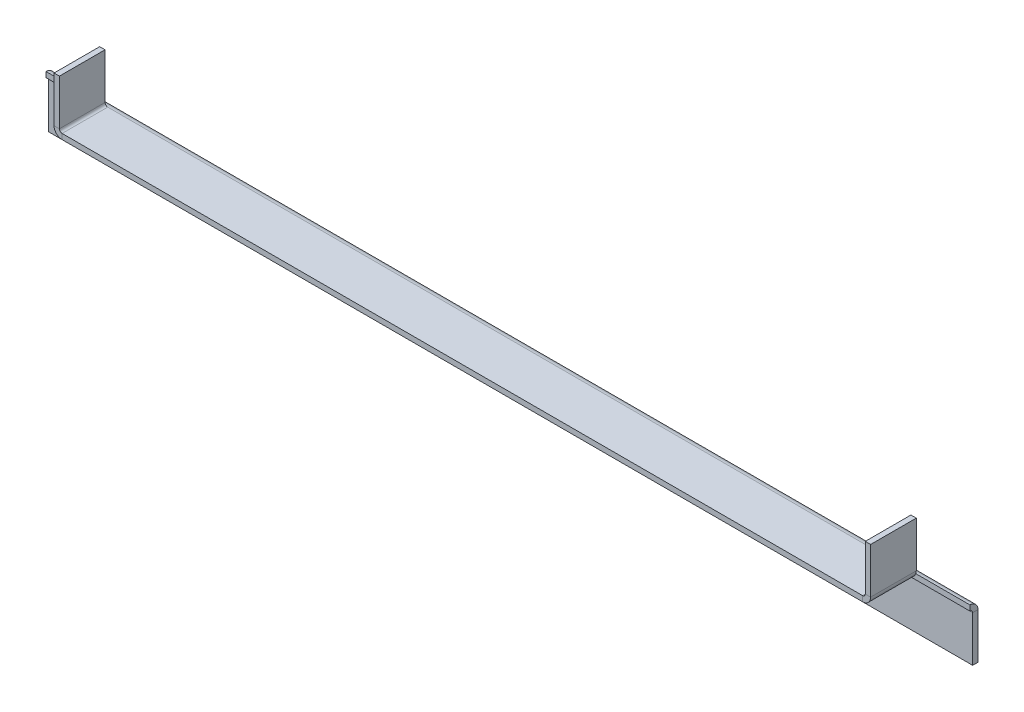
ISO-10303-21;
HEADER;
FILE_DESCRIPTION(('STEP AP214'),'2;1');
FILE_NAME('part.step','',(''),(''),'','','');
FILE_SCHEMA(('AUTOMOTIVE_DESIGN { 1 0 10303 214 1 1 1 1 }'));
ENDSEC;
DATA;
#1=APPLICATION_CONTEXT('core data for automotive mechanical design processes');
#2=APPLICATION_PROTOCOL_DEFINITION('international standard','automotive_design',2000,#1);
#3=PRODUCT_CONTEXT('',#1,'mechanical');
#4=PRODUCT('Part','Part','',(#3));
#5=PRODUCT_RELATED_PRODUCT_CATEGORY('part','',(#4));
#6=PRODUCT_DEFINITION_FORMATION('','',#4);
#7=PRODUCT_DEFINITION_CONTEXT('part definition',#1,'design');
#8=PRODUCT_DEFINITION('design','',#6,#7);
#9=PRODUCT_DEFINITION_SHAPE('','',#8);
#10=(LENGTH_UNIT() NAMED_UNIT(*) SI_UNIT(.MILLI.,.METRE.));
#11=(NAMED_UNIT(*) PLANE_ANGLE_UNIT() SI_UNIT($,.RADIAN.));
#12=(NAMED_UNIT(*) SI_UNIT($,.STERADIAN.) SOLID_ANGLE_UNIT());
#13=UNCERTAINTY_MEASURE_WITH_UNIT(LENGTH_MEASURE(1.E-05),#10,'distance_accuracy_value','');
#14=(GEOMETRIC_REPRESENTATION_CONTEXT(3) GLOBAL_UNCERTAINTY_ASSIGNED_CONTEXT((#13)) GLOBAL_UNIT_ASSIGNED_CONTEXT((#10,
#11,#12)) REPRESENTATION_CONTEXT('',''));
#15=CARTESIAN_POINT('',(0.,0.,0.));
#16=DIRECTION('',(0.,0.,1.));
#17=DIRECTION('',(1.,0.,0.));
#18=AXIS2_PLACEMENT_3D('',#15,#16,#17);
#19=CARTESIAN_POINT('',(344.2,20.,0.999999999999992));
#20=DIRECTION('',(0.,0.,1.));
#21=DIRECTION('',(0.,-1.,0.));
#22=AXIS2_PLACEMENT_3D('',#19,#20,#21);
#23=PLANE('',#22);
#24=DIRECTION('',(-1.,0.,0.));
#25=VECTOR('',#24,1.);
#26=CARTESIAN_POINT('',(344.2,20.,0.999999999999992));
#27=LINE('',#26,#25);
#28=CARTESIAN_POINT('',(344.2,20.,0.999999999999992));
#29=VERTEX_POINT('',#28);
#30=CARTESIAN_POINT('',(324.028427124746,20.,0.999999999999993));
#31=VERTEX_POINT('',#30);
#32=EDGE_CURVE('E290',#29,#31,#27,.T.);
#33=ORIENTED_EDGE('',*,*,#32,.T.);
#34=CARTESIAN_POINT('',(321.2,21.,0.99999999999999));
#35=DIRECTION('',(0.,0.,-1.));
#36=DIRECTION('',(0.,1.,0.));
#37=AXIS2_PLACEMENT_3D('',#34,#35,#36);
#38=CIRCLE('',#37,3.);
#39=CARTESIAN_POINT('',(321.2,18.,0.999999999999998));
#40=VERTEX_POINT('',#39);
#41=EDGE_CURVE('E13',#31,#40,#38,.T.);
#42=ORIENTED_EDGE('',*,*,#41,.T.);
#43=DIRECTION('',(-1.,0.,0.));
#44=VECTOR('',#43,1.);
#45=CARTESIAN_POINT('',(344.2,18.,0.999999999999997));
#46=LINE('',#45,#44);
#47=CARTESIAN_POINT('',(344.2,18.,0.999999999999999));
#48=VERTEX_POINT('',#47);
#49=EDGE_CURVE('E359',#48,#40,#46,.T.);
#50=ORIENTED_EDGE('',*,*,#49,.F.);
#51=DIRECTION('',(0.,-1.,0.));
#52=VECTOR('',#51,1.);
#53=CARTESIAN_POINT('',(344.2,20.,0.99999999999999));
#54=LINE('',#53,#52);
#55=EDGE_CURVE('E345',#48,#29,#54,.F.);
#56=ORIENTED_EDGE('',*,*,#55,.T.);
#57=EDGE_LOOP('',(#33,#42,#50,#56));
#58=FACE_BOUND('',#57,.T.);
#59=ADVANCED_FACE('F98',(#58),#23,.T.);
#60=CARTESIAN_POINT('',(0.,20.,0.));
#61=DIRECTION('',(0.,-1.,0.));
#62=DIRECTION('',(0.,0.,-1.));
#63=AXIS2_PLACEMENT_3D('',#60,#61,#62);
#64=PLANE('',#63);
#65=DIRECTION('',(0.,0.,-1.));
#66=VECTOR('',#65,1.);
#67=CARTESIAN_POINT('',(321.2,20.,0.999999999999994));
#68=LINE('',#67,#66);
#69=CARTESIAN_POINT('',(321.2,20.,0.999999999999994));
#70=VERTEX_POINT('',#69);
#71=CARTESIAN_POINT('',(321.2,20.0000000000001,18.));
#72=VERTEX_POINT('',#71);
#73=EDGE_CURVE('E283',#70,#72,#68,.F.);
#74=ORIENTED_EDGE('',*,*,#73,.F.);
#75=DIRECTION('',(-1.,0.,0.));
#76=VECTOR('',#75,1.);
#77=CARTESIAN_POINT('',(344.2,20.,0.99999999999999));
#78=LINE('',#77,#76);
#79=CARTESIAN_POINT('',(23.,20.,0.999999999999994));
#80=VERTEX_POINT('',#79);
#81=EDGE_CURVE('E355',#80,#70,#78,.F.);
#82=ORIENTED_EDGE('',*,*,#81,.F.);
#83=DIRECTION('',(0.,0.,1.));
#84=VECTOR('',#83,1.);
#85=CARTESIAN_POINT('',(23.,20.0000000000001,18.));
#86=LINE('',#85,#84);
#87=CARTESIAN_POINT('',(23.,20.0000000000001,18.));
#88=VERTEX_POINT('',#87);
#89=EDGE_CURVE('E338',#88,#80,#86,.F.);
#90=ORIENTED_EDGE('',*,*,#89,.F.);
#91=DIRECTION('',(1.,0.,0.));
#92=VECTOR('',#91,1.);
#93=CARTESIAN_POINT('',(0.,20.0000000000001,18.));
#94=LINE('',#93,#92);
#95=EDGE_CURVE('E346',#88,#72,#94,.T.);
#96=ORIENTED_EDGE('',*,*,#95,.T.);
#97=EDGE_LOOP('',(#74,#82,#90,#96));
#98=FACE_BOUND('',#97,.T.);
#99=ADVANCED_FACE('F427',(#98),#64,.F.);
#100=CARTESIAN_POINT('',(0.,18.,0.));
#101=DIRECTION('',(0.,-1.,0.));
#102=DIRECTION('',(0.,0.,-1.));
#103=AXIS2_PLACEMENT_3D('',#100,#101,#102);
#104=PLANE('',#103);
#105=CARTESIAN_POINT('',(23.,18.,1.));
#106=VERTEX_POINT('',#105);
#107=EDGE_CURVE('E362',#40,#106,#46,.T.);
#108=ORIENTED_EDGE('',*,*,#107,.F.);
#109=DIRECTION('',(0.,0.,-1.));
#110=VECTOR('',#109,1.);
#111=CARTESIAN_POINT('',(321.2,18.,1.));
#112=LINE('',#111,#110);
#113=CARTESIAN_POINT('',(321.2,18.0000000000001,18.));
#114=VERTEX_POINT('',#113);
#115=EDGE_CURVE('E274',#40,#114,#112,.F.);
#116=ORIENTED_EDGE('',*,*,#115,.T.);
#117=DIRECTION('',(-1.,0.,0.));
#118=VECTOR('',#117,1.);
#119=CARTESIAN_POINT('',(344.2,18.0000000000001,18.));
#120=LINE('',#119,#118);
#121=CARTESIAN_POINT('',(23.,18.0000000000001,18.));
#122=VERTEX_POINT('',#121);
#123=EDGE_CURVE('E349',#122,#114,#120,.F.);
#124=ORIENTED_EDGE('',*,*,#123,.F.);
#125=DIRECTION('',(0.,0.,1.));
#126=VECTOR('',#125,1.);
#127=CARTESIAN_POINT('',(23.,18.0000000000001,18.));
#128=LINE('',#127,#126);
#129=EDGE_CURVE('E324',#122,#106,#128,.F.);
#130=ORIENTED_EDGE('',*,*,#129,.T.);
#131=EDGE_LOOP('',(#108,#116,#124,#130));
#132=FACE_BOUND('',#131,.T.);
#133=ADVANCED_FACE('F433',(#132),#104,.T.);
#134=CARTESIAN_POINT('',(344.2,20.0000000000001,18.));
#135=DIRECTION('',(0.,0.,-1.));
#136=DIRECTION('',(0.,1.,0.));
#137=AXIS2_PLACEMENT_3D('',#134,#135,#136);
#138=PLANE('',#137);
#139=DIRECTION('',(0.,-1.,0.));
#140=VECTOR('',#139,1.);
#141=CARTESIAN_POINT('',(321.2,20.0000000000001,18.));
#142=LINE('',#141,#140);
#143=EDGE_CURVE('E123',#72,#114,#142,.T.);
#144=ORIENTED_EDGE('',*,*,#143,.F.);
#145=ORIENTED_EDGE('',*,*,#95,.F.);
#146=DIRECTION('',(0.,-1.,0.));
#147=VECTOR('',#146,1.);
#148=CARTESIAN_POINT('',(23.,20.0000000000001,18.));
#149=LINE('',#148,#147);
#150=EDGE_CURVE('E332',#88,#122,#149,.T.);
#151=ORIENTED_EDGE('',*,*,#150,.T.);
#152=ORIENTED_EDGE('',*,*,#123,.T.);
#153=EDGE_LOOP('',(#144,#145,#151,#152));
#154=FACE_BOUND('',#153,.T.);
#155=ADVANCED_FACE('F481',(#154),#138,.F.);
#156=CARTESIAN_POINT('',(23.,20.,0.999999999999994));
#157=DIRECTION('',(0.,0.,1.));
#158=DIRECTION('',(0.,-1.,0.));
#159=AXIS2_PLACEMENT_3D('',#156,#157,#158);
#160=PLANE('',#159);
#161=CARTESIAN_POINT('',(0.,18.,0.999999999999999));
#162=VERTEX_POINT('',#161);
#163=EDGE_CURVE('E363',#106,#162,#46,.T.);
#164=ORIENTED_EDGE('',*,*,#163,.F.);
#165=CARTESIAN_POINT('',(23.,21.,0.99999999999999));
#166=DIRECTION('',(0.,0.,1.));
#167=DIRECTION('',(0.,-1.,0.));
#168=AXIS2_PLACEMENT_3D('',#165,#166,#167);
#169=CIRCLE('',#168,3.);
#170=CARTESIAN_POINT('',(20.1715728752538,20.,0.999999999999994));
#171=VERTEX_POINT('',#170);
#172=EDGE_CURVE('E329',#106,#171,#169,.F.);
#173=ORIENTED_EDGE('',*,*,#172,.T.);
#174=CARTESIAN_POINT('',(0.,20.,0.999999999999994));
#175=VERTEX_POINT('',#174);
#176=EDGE_CURVE('E351',#175,#171,#78,.F.);
#177=ORIENTED_EDGE('',*,*,#176,.F.);
#178=DIRECTION('',(0.,-1.,0.));
#179=VECTOR('',#178,1.);
#180=CARTESIAN_POINT('',(0.,18.,1.));
#181=LINE('',#180,#179);
#182=EDGE_CURVE('E356',#162,#175,#181,.F.);
#183=ORIENTED_EDGE('',*,*,#182,.F.);
#184=EDGE_LOOP('',(#164,#173,#177,#183));
#185=FACE_BOUND('',#184,.T.);
#186=ADVANCED_FACE('F478',(#185),#160,.T.);
#187=CARTESIAN_POINT('',(0.,0.,-2.));
#188=DIRECTION('',(1.,0.,0.));
#189=DIRECTION('',(0.,1.,0.));
#190=AXIS2_PLACEMENT_3D('',#187,#188,#189);
#191=PLANE('',#190);
#192=DIRECTION('',(0.,1.,0.));
#193=VECTOR('',#192,1.);
#194=CARTESIAN_POINT('',(0.,0.,0.));
#195=LINE('',#194,#193);
#196=CARTESIAN_POINT('',(0.,0.,0.));
#197=VERTEX_POINT('',#196);
#198=CARTESIAN_POINT('',(0.,17.,0.));
#199=VERTEX_POINT('',#198);
#200=EDGE_CURVE('E385',#197,#199,#195,.T.);
#201=ORIENTED_EDGE('',*,*,#200,.T.);
#202=DIRECTION('',(0.,0.,-1.));
#203=VECTOR('',#202,1.);
#204=CARTESIAN_POINT('',(0.,17.,0.));
#205=LINE('',#204,#203);
#206=CARTESIAN_POINT('',(0.,17.,-2.));
#207=VERTEX_POINT('',#206);
#208=EDGE_CURVE('E371',#199,#207,#205,.T.);
#209=ORIENTED_EDGE('',*,*,#208,.T.);
#210=DIRECTION('',(0.,1.,0.));
#211=VECTOR('',#210,1.);
#212=CARTESIAN_POINT('',(0.,0.,-2.));
#213=LINE('',#212,#211);
#214=CARTESIAN_POINT('',(0.,0.,-2.));
#215=VERTEX_POINT('',#214);
#216=EDGE_CURVE('E388',#215,#207,#213,.T.);
#217=ORIENTED_EDGE('',*,*,#216,.F.);
#218=DIRECTION('',(0.,0.,-1.));
#219=VECTOR('',#218,1.);
#220=CARTESIAN_POINT('',(0.,0.,-2.));
#221=LINE('',#220,#219);
#222=EDGE_CURVE('E397',#197,#215,#221,.T.);
#223=ORIENTED_EDGE('',*,*,#222,.F.);
#224=EDGE_LOOP('',(#201,#209,#217,#223));
#225=FACE_BOUND('',#224,.T.);
#226=ADVANCED_FACE('F480',(#225),#191,.F.);
#227=CARTESIAN_POINT('',(344.2,0.,-2.));
#228=DIRECTION('',(0.,0.,1.));
#229=DIRECTION('',(1.,0.,0.));
#230=AXIS2_PLACEMENT_3D('',#227,#228,#229);
#231=PLANE('',#230);
#232=DIRECTION('',(-1.,0.,0.));
#233=VECTOR('',#232,1.);
#234=CARTESIAN_POINT('',(0.,17.,-2.));
#235=LINE('',#234,#233);
#236=CARTESIAN_POINT('',(344.2,17.,-2.));
#237=VERTEX_POINT('',#236);
#238=EDGE_CURVE('E366',#207,#237,#235,.F.);
#239=ORIENTED_EDGE('',*,*,#238,.T.);
#240=DIRECTION('',(0.,1.,0.));
#241=VECTOR('',#240,1.);
#242=CARTESIAN_POINT('',(344.2,0.,-2.));
#243=LINE('',#242,#241);
#244=CARTESIAN_POINT('',(344.2,0.,-2.));
#245=VERTEX_POINT('',#244);
#246=EDGE_CURVE('E390',#245,#237,#243,.T.);
#247=ORIENTED_EDGE('',*,*,#246,.F.);
#248=DIRECTION('',(-1.,0.,0.));
#249=VECTOR('',#248,1.);
#250=CARTESIAN_POINT('',(344.2,0.,-2.));
#251=LINE('',#250,#249);
#252=EDGE_CURVE('E394',#245,#215,#251,.T.);
#253=ORIENTED_EDGE('',*,*,#252,.T.);
#254=ORIENTED_EDGE('',*,*,#216,.T.);
#255=EDGE_LOOP('',(#239,#247,#253,#254));
#256=FACE_BOUND('',#255,.T.);
#257=ADVANCED_FACE('F412',(#256),#231,.F.);
#258=CARTESIAN_POINT('',(344.2,0.,0.));
#259=DIRECTION('',(0.,0.,1.));
#260=DIRECTION('',(1.,0.,0.));
#261=AXIS2_PLACEMENT_3D('',#258,#259,#260);
#262=PLANE('',#261);
#263=DIRECTION('',(0.,1.,0.));
#264=VECTOR('',#263,1.);
#265=CARTESIAN_POINT('',(344.2,0.,0.));
#266=LINE('',#265,#264);
#267=CARTESIAN_POINT('',(344.2,0.,0.));
#268=VERTEX_POINT('',#267);
#269=CARTESIAN_POINT('',(344.2,17.,0.));
#270=VERTEX_POINT('',#269);
#271=EDGE_CURVE('E400',#268,#270,#266,.T.);
#272=ORIENTED_EDGE('',*,*,#271,.T.);
#273=DIRECTION('',(-1.,0.,0.));
#274=VECTOR('',#273,1.);
#275=CARTESIAN_POINT('',(0.,17.,0.));
#276=LINE('',#275,#274);
#277=EDGE_CURVE('E377',#199,#270,#276,.F.);
#278=ORIENTED_EDGE('',*,*,#277,.F.);
#279=ORIENTED_EDGE('',*,*,#200,.F.);
#280=DIRECTION('',(1.,0.,0.));
#281=VECTOR('',#280,1.);
#282=CARTESIAN_POINT('',(344.2,0.,0.));
#283=LINE('',#282,#281);
#284=EDGE_CURVE('E391',#268,#197,#283,.F.);
#285=ORIENTED_EDGE('',*,*,#284,.F.);
#286=EDGE_LOOP('',(#272,#278,#279,#285));
#287=FACE_BOUND('',#286,.T.);
#288=ADVANCED_FACE('F424',(#287),#262,.T.);
#289=CARTESIAN_POINT('',(344.2,0.,-2.));
#290=DIRECTION('',(1.,0.,0.));
#291=DIRECTION('',(0.,1.,0.));
#292=AXIS2_PLACEMENT_3D('',#289,#290,#291);
#293=PLANE('',#292);
#294=DIRECTION('',(0.,0.,-1.));
#295=VECTOR('',#294,1.);
#296=CARTESIAN_POINT('',(344.2,17.,0.));
#297=LINE('',#296,#295);
#298=EDGE_CURVE('E382',#270,#237,#297,.T.);
#299=ORIENTED_EDGE('',*,*,#298,.F.);
#300=ORIENTED_EDGE('',*,*,#271,.F.);
#301=DIRECTION('',(0.,0.,-1.));
#302=VECTOR('',#301,1.);
#303=CARTESIAN_POINT('',(344.2,0.,-2.));
#304=LINE('',#303,#302);
#305=EDGE_CURVE('E102',#268,#245,#304,.T.);
#306=ORIENTED_EDGE('',*,*,#305,.T.);
#307=ORIENTED_EDGE('',*,*,#246,.T.);
#308=EDGE_LOOP('',(#299,#300,#306,#307));
#309=FACE_BOUND('',#308,.T.);
#310=ADVANCED_FACE('F100',(#309),#293,.T.);
#311=CARTESIAN_POINT('',(344.2,0.,-2.));
#312=DIRECTION('',(0.,1.,0.));
#313=DIRECTION('',(-1.,0.,0.));
#314=AXIS2_PLACEMENT_3D('',#311,#312,#313);
#315=PLANE('',#314);
#316=ORIENTED_EDGE('',*,*,#305,.F.);
#317=ORIENTED_EDGE('',*,*,#284,.T.);
#318=ORIENTED_EDGE('',*,*,#222,.T.);
#319=ORIENTED_EDGE('',*,*,#252,.F.);
#320=EDGE_LOOP('',(#316,#317,#318,#319));
#321=FACE_BOUND('',#320,.T.);
#322=ADVANCED_FACE('F414',(#321),#315,.F.);
#323=CARTESIAN_POINT('',(344.2,17.,1.));
#324=DIRECTION('',(1.,0.,0.));
#325=DIRECTION('',(0.,0.,-1.));
#326=AXIS2_PLACEMENT_3D('',#323,#324,#325);
#327=PLANE('',#326);
#328=ORIENTED_EDGE('',*,*,#55,.F.);
#329=CARTESIAN_POINT('',(344.2,17.,1.));
#330=DIRECTION('',(-1.,0.,0.));
#331=DIRECTION('',(0.,0.,1.));
#332=AXIS2_PLACEMENT_3D('',#329,#330,#331);
#333=CIRCLE('',#332,1.);
#334=EDGE_CURVE('E374',#270,#48,#333,.F.);
#335=ORIENTED_EDGE('',*,*,#334,.F.);
#336=ORIENTED_EDGE('',*,*,#298,.T.);
#337=CARTESIAN_POINT('',(344.2,17.,1.));
#338=DIRECTION('',(-1.,0.,0.));
#339=DIRECTION('',(0.,0.,1.));
#340=AXIS2_PLACEMENT_3D('',#337,#338,#339);
#341=CIRCLE('',#340,3.);
#342=EDGE_CURVE('E368',#237,#29,#341,.F.);
#343=ORIENTED_EDGE('',*,*,#342,.T.);
#344=EDGE_LOOP('',(#328,#335,#336,#343));
#345=FACE_BOUND('',#344,.T.);
#346=ADVANCED_FACE('F416',(#345),#327,.T.);
#347=CARTESIAN_POINT('',(0.,17.,1.));
#348=DIRECTION('',(1.,0.,0.));
#349=DIRECTION('',(0.,0.,-1.));
#350=AXIS2_PLACEMENT_3D('',#347,#348,#349);
#351=PLANE('',#350);
#352=CARTESIAN_POINT('',(0.,17.,1.));
#353=DIRECTION('',(-1.,0.,0.));
#354=DIRECTION('',(0.,0.,1.));
#355=AXIS2_PLACEMENT_3D('',#352,#353,#354);
#356=CIRCLE('',#355,1.);
#357=EDGE_CURVE('E348',#162,#199,#356,.T.);
#358=ORIENTED_EDGE('',*,*,#357,.F.);
#359=ORIENTED_EDGE('',*,*,#182,.T.);
#360=CARTESIAN_POINT('',(0.,17.,1.));
#361=DIRECTION('',(-1.,0.,0.));
#362=DIRECTION('',(0.,0.,1.));
#363=AXIS2_PLACEMENT_3D('',#360,#361,#362);
#364=CIRCLE('',#363,3.);
#365=EDGE_CURVE('E369',#175,#207,#364,.T.);
#366=ORIENTED_EDGE('',*,*,#365,.T.);
#367=ORIENTED_EDGE('',*,*,#208,.F.);
#368=EDGE_LOOP('',(#358,#359,#366,#367));
#369=FACE_BOUND('',#368,.T.);
#370=ADVANCED_FACE('F421',(#369),#351,.F.);
#371=CARTESIAN_POINT('',(0.,17.,1.));
#372=DIRECTION('',(-1.,0.,0.));
#373=DIRECTION('',(0.,1.,0.));
#374=AXIS2_PLACEMENT_3D('',#371,#372,#373);
#375=CYLINDRICAL_SURFACE('',#374,3.);
#376=ORIENTED_EDGE('',*,*,#238,.F.);
#377=ORIENTED_EDGE('',*,*,#365,.F.);
#378=ORIENTED_EDGE('',*,*,#176,.T.);
#379=EDGE_CURVE('E354',#171,#80,#78,.F.);
#380=ORIENTED_EDGE('',*,*,#379,.T.);
#381=ORIENTED_EDGE('',*,*,#81,.T.);
#382=EDGE_CURVE('E115',#31,#70,#27,.T.);
#383=ORIENTED_EDGE('',*,*,#382,.F.);
#384=ORIENTED_EDGE('',*,*,#32,.F.);
#385=ORIENTED_EDGE('',*,*,#342,.F.);
#386=EDGE_LOOP('',(#376,#377,#378,#380,#381,#383,#384,#385));
#387=FACE_BOUND('',#386,.T.);
#388=ADVANCED_FACE('F489',(#387),#375,.T.);
#389=CARTESIAN_POINT('',(0.,17.,1.));
#390=DIRECTION('',(-1.,0.,0.));
#391=DIRECTION('',(0.,1.,0.));
#392=AXIS2_PLACEMENT_3D('',#389,#390,#391);
#393=CYLINDRICAL_SURFACE('',#392,1.);
#394=ORIENTED_EDGE('',*,*,#277,.T.);
#395=ORIENTED_EDGE('',*,*,#334,.T.);
#396=ORIENTED_EDGE('',*,*,#49,.T.);
#397=ORIENTED_EDGE('',*,*,#107,.T.);
#398=ORIENTED_EDGE('',*,*,#163,.T.);
#399=ORIENTED_EDGE('',*,*,#357,.T.);
#400=EDGE_LOOP('',(#394,#395,#396,#397,#398,#399));
#401=FACE_BOUND('',#400,.T.);
#402=ADVANCED_FACE('F473',(#401),#393,.F.);
#403=CARTESIAN_POINT('',(23.,21.,0.99999999999999));
#404=DIRECTION('',(0.,0.,-1.));
#405=DIRECTION('',(0.,1.,0.));
#406=AXIS2_PLACEMENT_3D('',#403,#404,#405);
#407=PLANE('',#406);
#408=ORIENTED_EDGE('',*,*,#379,.F.);
#409=CARTESIAN_POINT('',(20.,21.,0.99999999999999));
#410=VERTEX_POINT('',#409);
#411=EDGE_CURVE('E327',#171,#410,#169,.F.);
#412=ORIENTED_EDGE('',*,*,#411,.T.);
#413=DIRECTION('',(1.,0.,0.));
#414=VECTOR('',#413,1.);
#415=CARTESIAN_POINT('',(20.,21.,0.999999999999991));
#416=LINE('',#415,#414);
#417=CARTESIAN_POINT('',(22.,21.,0.99999999999999));
#418=VERTEX_POINT('',#417);
#419=EDGE_CURVE('E292',#418,#410,#416,.F.);
#420=ORIENTED_EDGE('',*,*,#419,.F.);
#421=CARTESIAN_POINT('',(23.,21.,0.99999999999999));
#422=DIRECTION('',(0.,0.,1.));
#423=DIRECTION('',(0.,-1.,0.));
#424=AXIS2_PLACEMENT_3D('',#421,#422,#423);
#425=CIRCLE('',#424,1.);
#426=EDGE_CURVE('E335',#80,#418,#425,.F.);
#427=ORIENTED_EDGE('',*,*,#426,.F.);
#428=EDGE_LOOP('',(#408,#412,#420,#427));
#429=FACE_BOUND('',#428,.T.);
#430=ADVANCED_FACE('F470',(#429),#407,.T.);
#431=CARTESIAN_POINT('',(23.,21.0000000000001,18.));
#432=DIRECTION('',(0.,0.,-1.));
#433=DIRECTION('',(0.,1.,0.));
#434=AXIS2_PLACEMENT_3D('',#431,#432,#433);
#435=PLANE('',#434);
#436=CARTESIAN_POINT('',(23.,21.0000000000001,18.));
#437=DIRECTION('',(0.,0.,1.));
#438=DIRECTION('',(0.,-1.,0.));
#439=AXIS2_PLACEMENT_3D('',#436,#437,#438);
#440=CIRCLE('',#439,1.);
#441=CARTESIAN_POINT('',(22.,21.0000000000001,18.));
#442=VERTEX_POINT('',#441);
#443=EDGE_CURVE('E296',#442,#88,#440,.T.);
#444=ORIENTED_EDGE('',*,*,#443,.F.);
#445=DIRECTION('',(1.,0.,0.));
#446=VECTOR('',#445,1.);
#447=CARTESIAN_POINT('',(22.,21.0000000000001,18.));
#448=LINE('',#447,#446);
#449=CARTESIAN_POINT('',(20.,21.,18.));
#450=VERTEX_POINT('',#449);
#451=EDGE_CURVE('E317',#442,#450,#448,.F.);
#452=ORIENTED_EDGE('',*,*,#451,.T.);
#453=CARTESIAN_POINT('',(23.,21.0000000000001,18.));
#454=DIRECTION('',(0.,0.,1.));
#455=DIRECTION('',(0.,-1.,0.));
#456=AXIS2_PLACEMENT_3D('',#453,#454,#455);
#457=CIRCLE('',#456,3.);
#458=EDGE_CURVE('E328',#450,#122,#457,.T.);
#459=ORIENTED_EDGE('',*,*,#458,.T.);
#460=ORIENTED_EDGE('',*,*,#150,.F.);
#461=EDGE_LOOP('',(#444,#452,#459,#460));
#462=FACE_BOUND('',#461,.T.);
#463=ADVANCED_FACE('F465',(#462),#435,.F.);
#464=CARTESIAN_POINT('',(23.,21.0000000000001,18.));
#465=DIRECTION('',(0.,0.,1.));
#466=DIRECTION('',(-1.,0.,0.));
#467=AXIS2_PLACEMENT_3D('',#464,#465,#466);
#468=CYLINDRICAL_SURFACE('',#467,3.);
#469=ORIENTED_EDGE('',*,*,#129,.F.);
#470=ORIENTED_EDGE('',*,*,#458,.F.);
#471=DIRECTION('',(0.,0.,1.));
#472=VECTOR('',#471,1.);
#473=CARTESIAN_POINT('',(20.,21.,0.999999999999965));
#474=LINE('',#473,#472);
#475=EDGE_CURVE('E314',#450,#410,#474,.F.);
#476=ORIENTED_EDGE('',*,*,#475,.T.);
#477=ORIENTED_EDGE('',*,*,#411,.F.);
#478=ORIENTED_EDGE('',*,*,#172,.F.);
#479=EDGE_LOOP('',(#469,#470,#476,#477,#478));
#480=FACE_BOUND('',#479,.T.);
#481=ADVANCED_FACE('F462',(#480),#468,.T.);
#482=CARTESIAN_POINT('',(23.,21.0000000000001,18.));
#483=DIRECTION('',(0.,0.,1.));
#484=DIRECTION('',(-1.,0.,0.));
#485=AXIS2_PLACEMENT_3D('',#482,#483,#484);
#486=CYLINDRICAL_SURFACE('',#485,1.);
#487=ORIENTED_EDGE('',*,*,#89,.T.);
#488=ORIENTED_EDGE('',*,*,#426,.T.);
#489=DIRECTION('',(0.,0.,1.));
#490=VECTOR('',#489,1.);
#491=CARTESIAN_POINT('',(22.,21.,0.999999999999965));
#492=LINE('',#491,#490);
#493=EDGE_CURVE('E320',#418,#442,#492,.T.);
#494=ORIENTED_EDGE('',*,*,#493,.T.);
#495=ORIENTED_EDGE('',*,*,#443,.T.);
#496=EDGE_LOOP('',(#487,#488,#494,#495));
#497=FACE_BOUND('',#496,.T.);
#498=ADVANCED_FACE('F460',(#497),#486,.F.);
#499=CARTESIAN_POINT('',(20.,20.,0.999999999999994));
#500=DIRECTION('',(0.,0.,1.));
#501=DIRECTION('',(0.,-1.,0.));
#502=AXIS2_PLACEMENT_3D('',#499,#500,#501);
#503=PLANE('',#502);
#504=ORIENTED_EDGE('',*,*,#419,.T.);
#505=DIRECTION('',(0.,-1.,0.));
#506=VECTOR('',#505,1.);
#507=CARTESIAN_POINT('',(20.0000000000001,0.,1.00000000000006));
#508=LINE('',#507,#506);
#509=CARTESIAN_POINT('',(19.9999999999999,38.,0.999999999999935));
#510=VERTEX_POINT('',#509);
#511=EDGE_CURVE('E304',#510,#410,#508,.T.);
#512=ORIENTED_EDGE('',*,*,#511,.F.);
#513=DIRECTION('',(1.,0.,0.));
#514=VECTOR('',#513,1.);
#515=CARTESIAN_POINT('',(19.9999999999999,38.,0.999999999999935));
#516=LINE('',#515,#514);
#517=CARTESIAN_POINT('',(21.9999999999999,38.,0.999999999999935));
#518=VERTEX_POINT('',#517);
#519=EDGE_CURVE('E297',#510,#518,#516,.T.);
#520=ORIENTED_EDGE('',*,*,#519,.T.);
#521=DIRECTION('',(0.,1.,0.));
#522=VECTOR('',#521,1.);
#523=CARTESIAN_POINT('',(22.,20.,0.999999999999994));
#524=LINE('',#523,#522);
#525=EDGE_CURVE('E311',#518,#418,#524,.F.);
#526=ORIENTED_EDGE('',*,*,#525,.T.);
#527=EDGE_LOOP('',(#504,#512,#520,#526));
#528=FACE_BOUND('',#527,.T.);
#529=ADVANCED_FACE('F456',(#528),#503,.F.);
#530=CARTESIAN_POINT('',(19.9999999999999,38.0000000000001,17.9999999999999));
#531=DIRECTION('',(0.,0.,-1.));
#532=DIRECTION('',(0.,1.,0.));
#533=AXIS2_PLACEMENT_3D('',#530,#531,#532);
#534=PLANE('',#533);
#535=ORIENTED_EDGE('',*,*,#451,.F.);
#536=DIRECTION('',(0.,-1.,0.));
#537=VECTOR('',#536,1.);
#538=CARTESIAN_POINT('',(21.9999999999999,38.0000000000001,17.9999999999999));
#539=LINE('',#538,#537);
#540=CARTESIAN_POINT('',(21.9999999999999,38.0000000000001,17.9999999999999));
#541=VERTEX_POINT('',#540);
#542=EDGE_CURVE('E309',#442,#541,#539,.F.);
#543=ORIENTED_EDGE('',*,*,#542,.T.);
#544=DIRECTION('',(1.,0.,0.));
#545=VECTOR('',#544,1.);
#546=CARTESIAN_POINT('',(19.9999999999999,38.0000000000001,17.9999999999999));
#547=LINE('',#546,#545);
#548=CARTESIAN_POINT('',(19.9999999999999,38.0000000000001,17.9999999999999));
#549=VERTEX_POINT('',#548);
#550=EDGE_CURVE('E293',#549,#541,#547,.T.);
#551=ORIENTED_EDGE('',*,*,#550,.F.);
#552=DIRECTION('',(0.,1.,0.));
#553=VECTOR('',#552,1.);
#554=CARTESIAN_POINT('',(20.0000000000001,0.,18.0000000000001));
#555=LINE('',#554,#553);
#556=EDGE_CURVE('E302',#450,#549,#555,.T.);
#557=ORIENTED_EDGE('',*,*,#556,.F.);
#558=EDGE_LOOP('',(#535,#543,#551,#557));
#559=FACE_BOUND('',#558,.T.);
#560=ADVANCED_FACE('F444',(#559),#534,.F.);
#561=CARTESIAN_POINT('',(20.0000000000001,0.,0.));
#562=DIRECTION('',(1.,0.,0.));
#563=DIRECTION('',(0.,1.,0.));
#564=AXIS2_PLACEMENT_3D('',#561,#562,#563);
#565=PLANE('',#564);
#566=ORIENTED_EDGE('',*,*,#475,.F.);
#567=ORIENTED_EDGE('',*,*,#556,.T.);
#568=DIRECTION('',(0.,0.,-1.));
#569=VECTOR('',#568,1.);
#570=CARTESIAN_POINT('',(19.9999999999999,38.,-1.39594218537428E-13));
#571=LINE('',#570,#569);
#572=EDGE_CURVE('E300',#549,#510,#571,.T.);
#573=ORIENTED_EDGE('',*,*,#572,.T.);
#574=ORIENTED_EDGE('',*,*,#511,.T.);
#575=EDGE_LOOP('',(#566,#567,#573,#574));
#576=FACE_BOUND('',#575,.T.);
#577=ADVANCED_FACE('F440',(#576),#565,.F.);
#578=CARTESIAN_POINT('',(22.0000000000001,0.,0.));
#579=DIRECTION('',(1.,0.,0.));
#580=DIRECTION('',(0.,1.,0.));
#581=AXIS2_PLACEMENT_3D('',#578,#579,#580);
#582=PLANE('',#581);
#583=ORIENTED_EDGE('',*,*,#542,.F.);
#584=ORIENTED_EDGE('',*,*,#493,.F.);
#585=ORIENTED_EDGE('',*,*,#525,.F.);
#586=DIRECTION('',(0.,0.,1.));
#587=VECTOR('',#586,1.);
#588=CARTESIAN_POINT('',(21.9999999999999,38.,0.999999999999935));
#589=LINE('',#588,#587);
#590=EDGE_CURVE('E307',#541,#518,#589,.F.);
#591=ORIENTED_EDGE('',*,*,#590,.F.);
#592=EDGE_LOOP('',(#583,#584,#585,#591));
#593=FACE_BOUND('',#592,.T.);
#594=ADVANCED_FACE('F443',(#593),#582,.T.);
#595=CARTESIAN_POINT('',(19.9999999999999,38.,0.999999999999935));
#596=DIRECTION('',(0.,-1.,0.));
#597=DIRECTION('',(0.,0.,-1.));
#598=AXIS2_PLACEMENT_3D('',#595,#596,#597);
#599=PLANE('',#598);
#600=ORIENTED_EDGE('',*,*,#590,.T.);
#601=ORIENTED_EDGE('',*,*,#519,.F.);
#602=ORIENTED_EDGE('',*,*,#572,.F.);
#603=ORIENTED_EDGE('',*,*,#550,.T.);
#604=EDGE_LOOP('',(#600,#601,#602,#603));
#605=FACE_BOUND('',#604,.T.);
#606=ADVANCED_FACE('F448',(#605),#599,.F.);
#607=CARTESIAN_POINT('',(321.2,21.0000000000001,18.));
#608=DIRECTION('',(0.,0.,1.));
#609=DIRECTION('',(0.,-1.,0.));
#610=AXIS2_PLACEMENT_3D('',#607,#608,#609);
#611=PLANE('',#610);
#612=DIRECTION('',(-1.,0.,0.));
#613=VECTOR('',#612,1.);
#614=CARTESIAN_POINT('',(324.2,21.0000000000001,18.));
#615=LINE('',#614,#613);
#616=CARTESIAN_POINT('',(322.2,21.0000000000001,18.));
#617=VERTEX_POINT('',#616);
#618=CARTESIAN_POINT('',(324.2,21.0000000000001,18.));
#619=VERTEX_POINT('',#618);
#620=EDGE_CURVE('E257',#617,#619,#615,.F.);
#621=ORIENTED_EDGE('',*,*,#620,.F.);
#622=CARTESIAN_POINT('',(321.2,21.0000000000001,18.));
#623=DIRECTION('',(0.,0.,-1.));
#624=DIRECTION('',(0.,1.,0.));
#625=AXIS2_PLACEMENT_3D('',#622,#623,#624);
#626=CIRCLE('',#625,1.);
#627=EDGE_CURVE('E280',#72,#617,#626,.F.);
#628=ORIENTED_EDGE('',*,*,#627,.F.);
#629=ORIENTED_EDGE('',*,*,#143,.T.);
#630=CARTESIAN_POINT('',(321.2,21.0000000000001,18.));
#631=DIRECTION('',(0.,0.,-1.));
#632=DIRECTION('',(0.,1.,0.));
#633=AXIS2_PLACEMENT_3D('',#630,#631,#632);
#634=CIRCLE('',#633,3.);
#635=EDGE_CURVE('E276',#114,#619,#634,.F.);
#636=ORIENTED_EDGE('',*,*,#635,.T.);
#637=EDGE_LOOP('',(#621,#628,#629,#636));
#638=FACE_BOUND('',#637,.T.);
#639=ADVANCED_FACE('F452',(#638),#611,.T.);
#640=CARTESIAN_POINT('',(321.2,21.,0.99999999999999));
#641=DIRECTION('',(0.,0.,1.));
#642=DIRECTION('',(0.,-1.,0.));
#643=AXIS2_PLACEMENT_3D('',#640,#641,#642);
#644=PLANE('',#643);
#645=CARTESIAN_POINT('',(324.2,21.,0.999999999999989));
#646=VERTEX_POINT('',#645);
#647=EDGE_CURVE('E108',#646,#31,#38,.T.);
#648=ORIENTED_EDGE('',*,*,#647,.T.);
#649=ORIENTED_EDGE('',*,*,#382,.T.);
#650=CARTESIAN_POINT('',(321.2,21.,0.99999999999999));
#651=DIRECTION('',(0.,0.,-1.));
#652=DIRECTION('',(0.,1.,0.));
#653=AXIS2_PLACEMENT_3D('',#650,#651,#652);
#654=CIRCLE('',#653,1.);
#655=CARTESIAN_POINT('',(322.2,21.,0.99999999999999));
#656=VERTEX_POINT('',#655);
#657=EDGE_CURVE('E286',#656,#70,#654,.T.);
#658=ORIENTED_EDGE('',*,*,#657,.F.);
#659=DIRECTION('',(-1.,0.,0.));
#660=VECTOR('',#659,1.);
#661=CARTESIAN_POINT('',(322.2,21.,0.99999999999999));
#662=LINE('',#661,#660);
#663=EDGE_CURVE('E268',#656,#646,#662,.F.);
#664=ORIENTED_EDGE('',*,*,#663,.T.);
#665=EDGE_LOOP('',(#648,#649,#658,#664));
#666=FACE_BOUND('',#665,.T.);
#667=ADVANCED_FACE('F438',(#666),#644,.F.);
#668=CARTESIAN_POINT('',(321.2,21.,0.99999999999999));
#669=DIRECTION('',(0.,0.,-1.));
#670=DIRECTION('',(1.,0.,0.));
#671=AXIS2_PLACEMENT_3D('',#668,#669,#670);
#672=CYLINDRICAL_SURFACE('',#671,3.);
#673=ORIENTED_EDGE('',*,*,#115,.F.);
#674=ORIENTED_EDGE('',*,*,#41,.F.);
#675=ORIENTED_EDGE('',*,*,#647,.F.);
#676=DIRECTION('',(0.,0.,-1.));
#677=VECTOR('',#676,1.);
#678=CARTESIAN_POINT('',(324.2,21.0000000000001,18.));
#679=LINE('',#678,#677);
#680=EDGE_CURVE('E266',#646,#619,#679,.F.);
#681=ORIENTED_EDGE('',*,*,#680,.T.);
#682=ORIENTED_EDGE('',*,*,#635,.F.);
#683=EDGE_LOOP('',(#673,#674,#675,#681,#682));
#684=FACE_BOUND('',#683,.T.);
#685=ADVANCED_FACE('F552',(#684),#672,.T.);
#686=CARTESIAN_POINT('',(321.2,21.,0.99999999999999));
#687=DIRECTION('',(0.,0.,-1.));
#688=DIRECTION('',(1.,0.,0.));
#689=AXIS2_PLACEMENT_3D('',#686,#687,#688);
#690=CYLINDRICAL_SURFACE('',#689,1.);
#691=ORIENTED_EDGE('',*,*,#73,.T.);
#692=ORIENTED_EDGE('',*,*,#627,.T.);
#693=DIRECTION('',(0.,0.,-1.));
#694=VECTOR('',#693,1.);
#695=CARTESIAN_POINT('',(322.2,21.0000000000001,18.));
#696=LINE('',#695,#694);
#697=EDGE_CURVE('E271',#617,#656,#696,.T.);
#698=ORIENTED_EDGE('',*,*,#697,.T.);
#699=ORIENTED_EDGE('',*,*,#657,.T.);
#700=EDGE_LOOP('',(#691,#692,#698,#699));
#701=FACE_BOUND('',#700,.T.);
#702=ADVANCED_FACE('F543',(#701),#690,.F.);
#703=CARTESIAN_POINT('',(324.2,20.0000000000001,18.));
#704=DIRECTION('',(0.,0.,-1.));
#705=DIRECTION('',(0.,1.,0.));
#706=AXIS2_PLACEMENT_3D('',#703,#704,#705);
#707=PLANE('',#706);
#708=ORIENTED_EDGE('',*,*,#620,.T.);
#709=DIRECTION('',(0.,-1.,0.));
#710=VECTOR('',#709,1.);
#711=CARTESIAN_POINT('',(324.2,-1.0094989381945E-12,18.0000000000001));
#712=LINE('',#711,#710);
#713=CARTESIAN_POINT('',(324.2,38.0000000000001,17.9999999999999));
#714=VERTEX_POINT('',#713);
#715=EDGE_CURVE('E238',#714,#619,#712,.T.);
#716=ORIENTED_EDGE('',*,*,#715,.F.);
#717=DIRECTION('',(-1.,0.,0.));
#718=VECTOR('',#717,1.);
#719=CARTESIAN_POINT('',(324.2,38.0000000000001,17.9999999999999));
#720=LINE('',#719,#718);
#721=CARTESIAN_POINT('',(322.2,38.0000000000001,17.9999999999999));
#722=VERTEX_POINT('',#721);
#723=EDGE_CURVE('E244',#714,#722,#720,.T.);
#724=ORIENTED_EDGE('',*,*,#723,.T.);
#725=DIRECTION('',(0.,1.,0.));
#726=VECTOR('',#725,1.);
#727=CARTESIAN_POINT('',(322.2,20.0000000000001,18.));
#728=LINE('',#727,#726);
#729=EDGE_CURVE('E264',#722,#617,#728,.F.);
#730=ORIENTED_EDGE('',*,*,#729,.T.);
#731=EDGE_LOOP('',(#708,#716,#724,#730));
#732=FACE_BOUND('',#731,.T.);
#733=ADVANCED_FACE('F256',(#732),#707,.F.);
#734=CARTESIAN_POINT('',(324.2,38.,0.999999999999937));
#735=DIRECTION('',(0.,0.,1.));
#736=DIRECTION('',(0.,-1.,0.));
#737=AXIS2_PLACEMENT_3D('',#734,#735,#736);
#738=PLANE('',#737);
#739=ORIENTED_EDGE('',*,*,#663,.F.);
#740=DIRECTION('',(0.,-1.,0.));
#741=VECTOR('',#740,1.);
#742=CARTESIAN_POINT('',(322.2,38.,0.999999999999937));
#743=LINE('',#742,#741);
#744=CARTESIAN_POINT('',(322.2,38.,0.999999999999935));
#745=VERTEX_POINT('',#744);
#746=EDGE_CURVE('E260',#656,#745,#743,.F.);
#747=ORIENTED_EDGE('',*,*,#746,.T.);
#748=DIRECTION('',(-1.,0.,0.));
#749=VECTOR('',#748,1.);
#750=CARTESIAN_POINT('',(324.2,38.,0.999999999999935));
#751=LINE('',#750,#749);
#752=CARTESIAN_POINT('',(324.2,38.,0.999999999999936));
#753=VERTEX_POINT('',#752);
#754=EDGE_CURVE('E253',#753,#745,#751,.T.);
#755=ORIENTED_EDGE('',*,*,#754,.F.);
#756=DIRECTION('',(0.,1.,0.));
#757=VECTOR('',#756,1.);
#758=CARTESIAN_POINT('',(324.2,-1.06539558353153E-12,1.00000000000005));
#759=LINE('',#758,#757);
#760=EDGE_CURVE('E240',#646,#753,#759,.T.);
#761=ORIENTED_EDGE('',*,*,#760,.F.);
#762=EDGE_LOOP('',(#739,#747,#755,#761));
#763=FACE_BOUND('',#762,.T.);
#764=ADVANCED_FACE('F549',(#763),#738,.F.);
#765=CARTESIAN_POINT('',(324.2,-1.06847953637772E-12,0.));
#766=DIRECTION('',(-1.,0.,0.));
#767=DIRECTION('',(0.,-1.,0.));
#768=AXIS2_PLACEMENT_3D('',#765,#766,#767);
#769=PLANE('',#768);
#770=ORIENTED_EDGE('',*,*,#680,.F.);
#771=ORIENTED_EDGE('',*,*,#760,.T.);
#772=DIRECTION('',(0.,0.,1.));
#773=VECTOR('',#772,1.);
#774=CARTESIAN_POINT('',(324.2,38.,-1.24083749811047E-13));
#775=LINE('',#774,#773);
#776=EDGE_CURVE('E233',#753,#714,#775,.T.);
#777=ORIENTED_EDGE('',*,*,#776,.T.);
#778=ORIENTED_EDGE('',*,*,#715,.T.);
#779=EDGE_LOOP('',(#770,#771,#777,#778));
#780=FACE_BOUND('',#779,.T.);
#781=ADVANCED_FACE('F236',(#780),#769,.F.);
#782=CARTESIAN_POINT('',(322.2,-1.0614965696555E-12,0.));
#783=DIRECTION('',(-1.,0.,0.));
#784=DIRECTION('',(0.,-1.,0.));
#785=AXIS2_PLACEMENT_3D('',#782,#783,#784);
#786=PLANE('',#785);
#787=ORIENTED_EDGE('',*,*,#746,.F.);
#788=ORIENTED_EDGE('',*,*,#697,.F.);
#789=ORIENTED_EDGE('',*,*,#729,.F.);
#790=DIRECTION('',(0.,0.,-1.));
#791=VECTOR('',#790,1.);
#792=CARTESIAN_POINT('',(322.2,38.0000000000001,17.9999999999999));
#793=LINE('',#792,#791);
#794=EDGE_CURVE('E249',#745,#722,#793,.F.);
#795=ORIENTED_EDGE('',*,*,#794,.F.);
#796=EDGE_LOOP('',(#787,#788,#789,#795));
#797=FACE_BOUND('',#796,.T.);
#798=ADVANCED_FACE('F547',(#797),#786,.T.);
#799=CARTESIAN_POINT('',(324.2,38.0000000000001,17.9999999999999));
#800=DIRECTION('',(0.,-1.,0.));
#801=DIRECTION('',(1.,0.,0.));
#802=AXIS2_PLACEMENT_3D('',#799,#800,#801);
#803=PLANE('',#802);
#804=ORIENTED_EDGE('',*,*,#794,.T.);
#805=ORIENTED_EDGE('',*,*,#723,.F.);
#806=ORIENTED_EDGE('',*,*,#776,.F.);
#807=ORIENTED_EDGE('',*,*,#754,.T.);
#808=EDGE_LOOP('',(#804,#805,#806,#807));
#809=FACE_BOUND('',#808,.T.);
#810=ADVANCED_FACE('F247',(#809),#803,.F.);
#811=CLOSED_SHELL('',(#59,#99,#133,#155,#186,#226,#257,#288,#310,#322,#346,#370,#388,#402,#430,
#463,#481,#498,#529,#560,#577,#594,#606,#639,#667,#685,#702,#733,#764,#781,#798,#810));
#812=MANIFOLD_SOLID_BREP('B2',#811);
#813=ADVANCED_BREP_SHAPE_REPRESENTATION('',(#18,#812),#14);
#814=SHAPE_DEFINITION_REPRESENTATION(#9,#813);
ENDSEC;
END-ISO-10303-21;
